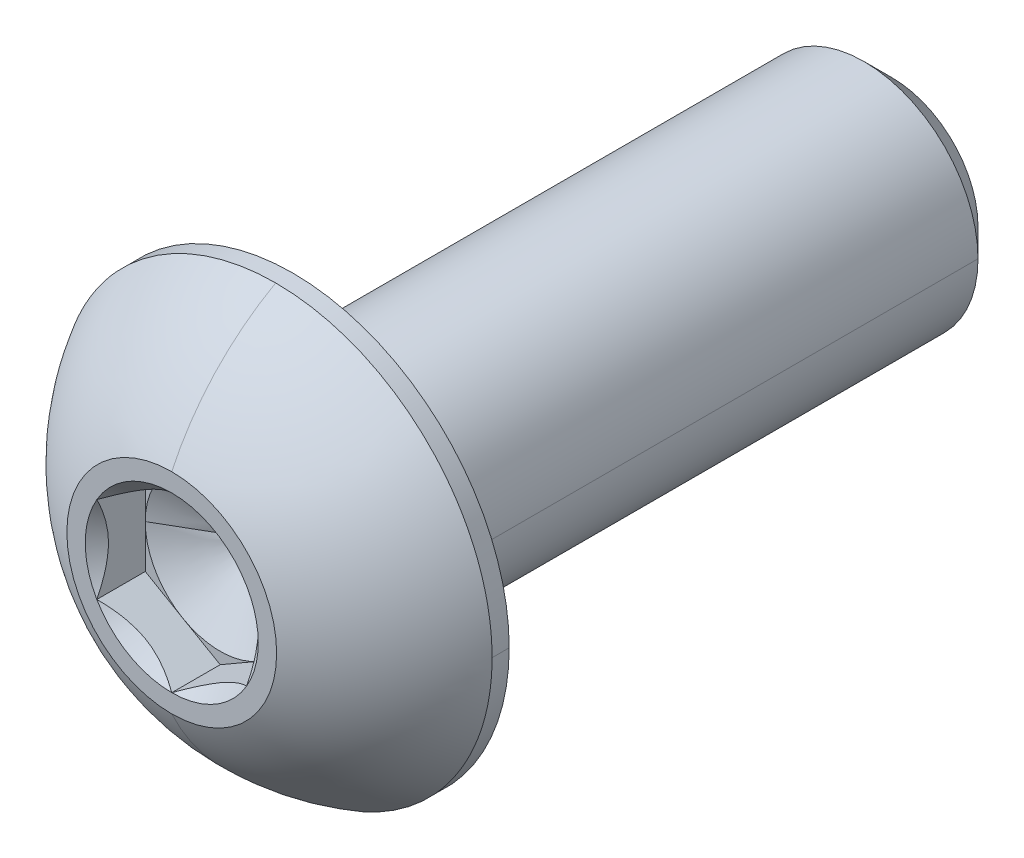
ISO-10303-21;
HEADER;
FILE_DESCRIPTION(('STEP AP214'),'2;1');
FILE_NAME('part.step','',(''),(''),'','','');
FILE_SCHEMA(('AUTOMOTIVE_DESIGN { 1 0 10303 214 1 1 1 1 }'));
ENDSEC;
DATA;
#1=APPLICATION_CONTEXT('core data for automotive mechanical design processes');
#2=APPLICATION_PROTOCOL_DEFINITION('international standard','automotive_design',2000,#1);
#3=PRODUCT_CONTEXT('',#1,'mechanical');
#4=PRODUCT('Part','Part','',(#3));
#5=PRODUCT_RELATED_PRODUCT_CATEGORY('part','',(#4));
#6=PRODUCT_DEFINITION_FORMATION('','',#4);
#7=PRODUCT_DEFINITION_CONTEXT('part definition',#1,'design');
#8=PRODUCT_DEFINITION('design','',#6,#7);
#9=PRODUCT_DEFINITION_SHAPE('','',#8);
#10=(LENGTH_UNIT() NAMED_UNIT(*) SI_UNIT(.MILLI.,.METRE.));
#11=(NAMED_UNIT(*) PLANE_ANGLE_UNIT() SI_UNIT($,.RADIAN.));
#12=(NAMED_UNIT(*) SI_UNIT($,.STERADIAN.) SOLID_ANGLE_UNIT());
#13=UNCERTAINTY_MEASURE_WITH_UNIT(LENGTH_MEASURE(1.E-05),#10,'distance_accuracy_value','');
#14=(GEOMETRIC_REPRESENTATION_CONTEXT(3) GLOBAL_UNCERTAINTY_ASSIGNED_CONTEXT((#13)) GLOBAL_UNIT_ASSIGNED_CONTEXT((#10,
#11,#12)) REPRESENTATION_CONTEXT('',''));
#15=CARTESIAN_POINT('',(0.,0.,0.));
#16=DIRECTION('',(0.,0.,1.));
#17=DIRECTION('',(1.,0.,0.));
#18=AXIS2_PLACEMENT_3D('',#15,#16,#17);
#19=CARTESIAN_POINT('',(0.,0.,7.6327));
#20=DIRECTION('',(0.,0.,1.));
#21=DIRECTION('',(1.,0.,0.));
#22=AXIS2_PLACEMENT_3D('',#19,#20,#21);
#23=CONICAL_SURFACE('',#22,1.83308710467706,0.78539816339745);
#24=CARTESIAN_POINT('',(0.,0.,7.6327));
#25=DIRECTION('',(0.,0.,1.));
#26=DIRECTION('',(1.,0.,0.));
#27=AXIS2_PLACEMENT_3D('',#24,#25,#26);
#28=CIRCLE('',#27,1.83308710467706);
#29=CARTESIAN_POINT('',(1.5875,0.916543552338531,7.6327));
#30=VERTEX_POINT('',#29);
#31=CARTESIAN_POINT('',(0.,1.83308710467706,7.6327));
#32=VERTEX_POINT('',#31);
#33=EDGE_CURVE('E202',#30,#32,#28,.T.);
#34=ORIENTED_EDGE('',*,*,#33,.T.);
#35=CARTESIAN_POINT('',(1.5875,0.916543552338532,7.6327));
#36=CARTESIAN_POINT('',(1.16394825928828,1.16108126385418,7.38816228848436));
#37=CARTESIAN_POINT('',(0.796673872668184,1.37312722983575,7.38711648546325));
#38=CARTESIAN_POINT('',(0.427185428297194,1.58645148265579,7.38606437797776));
#39=CARTESIAN_POINT('',(0.,1.83308710467706,7.6327));
#40=B_SPLINE_CURVE_WITH_KNOTS('',2,(#35,#36,#37,#38,#39),.UNSPECIFIED.,.F.,.F.,(3,2,3),(0.,0.5,
1.),.UNSPECIFIED.);
#41=EDGE_CURVE('E386',#30,#32,#40,.T.);
#42=ORIENTED_EDGE('',*,*,#41,.F.);
#43=EDGE_LOOP('',(#34,#42));
#44=FACE_BOUND('',#43,.T.);
#45=ADVANCED_FACE('F16',(#44),#23,.F.);
#46=CARTESIAN_POINT('',(0.,0.,7.6327));
#47=DIRECTION('',(0.,0.,1.));
#48=DIRECTION('',(1.,0.,0.));
#49=AXIS2_PLACEMENT_3D('',#46,#47,#48);
#50=CONICAL_SURFACE('',#49,1.83308710467706,0.78539816339745);
#51=DIRECTION('',(0.707106781186549,0.,0.707106781186546));
#52=VECTOR('',#51,1.);
#53=CARTESIAN_POINT('',(1.83308710467706,0.,7.6327));
#54=LINE('',#53,#52);
#55=CARTESIAN_POINT('',(1.5875,0.,7.38711289532294));
#56=VERTEX_POINT('',#55);
#57=CARTESIAN_POINT('',(1.83308710467706,0.,7.6327));
#58=VERTEX_POINT('',#57);
#59=EDGE_CURVE('E155',#56,#58,#54,.T.);
#60=ORIENTED_EDGE('',*,*,#59,.F.);
#61=CARTESIAN_POINT('',(1.5875,-0.916543552338531,7.6327));
#62=CARTESIAN_POINT('',(1.5875,-0.684378986322148,7.51661771699181));
#63=CARTESIAN_POINT('',(1.5875,-0.471870631820659,7.45575846355504));
#64=CARTESIAN_POINT('',(1.5875,-0.232174021608713,7.38711289532294));
#65=CARTESIAN_POINT('',(1.5875,0.,7.38711289532294));
#66=B_SPLINE_CURVE_WITH_KNOTS('',2,(#61,#62,#63,#64,#65),.UNSPECIFIED.,.F.,.F.,(3,2,3),(0.,0.5,
1.),.UNSPECIFIED.);
#67=CARTESIAN_POINT('',(1.5875,-0.916543552338531,7.6327));
#68=VERTEX_POINT('',#67);
#69=EDGE_CURVE('E148',#68,#56,#66,.T.);
#70=ORIENTED_EDGE('',*,*,#69,.F.);
#71=CARTESIAN_POINT('',(0.,0.,7.6327));
#72=DIRECTION('',(0.,0.,1.));
#73=DIRECTION('',(1.,0.,0.));
#74=AXIS2_PLACEMENT_3D('',#71,#72,#73);
#75=CIRCLE('',#74,1.83308710467706);
#76=EDGE_CURVE('E152',#68,#58,#75,.T.);
#77=ORIENTED_EDGE('',*,*,#76,.T.);
#78=EDGE_LOOP('',(#60,#70,#77));
#79=FACE_BOUND('',#78,.T.);
#80=ADVANCED_FACE('F150',(#79),#50,.F.);
#81=CARTESIAN_POINT('',(0.,0.,7.6327));
#82=DIRECTION('',(0.,0.,1.));
#83=DIRECTION('',(1.,0.,0.));
#84=AXIS2_PLACEMENT_3D('',#81,#82,#83);
#85=CONICAL_SURFACE('',#84,1.83308710467706,0.78539816339745);
#86=CARTESIAN_POINT('',(0.,0.,7.6327));
#87=DIRECTION('',(0.,0.,1.));
#88=DIRECTION('',(1.,0.,0.));
#89=AXIS2_PLACEMENT_3D('',#86,#87,#88);
#90=CIRCLE('',#89,1.83308710467706);
#91=CARTESIAN_POINT('',(0.,-1.83308710467706,7.6327));
#92=VERTEX_POINT('',#91);
#93=EDGE_CURVE('E188',#92,#68,#90,.T.);
#94=ORIENTED_EDGE('',*,*,#93,.T.);
#95=CARTESIAN_POINT('',(0.,-1.83308710467706,7.6327));
#96=CARTESIAN_POINT('',(0.423551740712969,-1.58854939316069,7.38816228848364));
#97=CARTESIAN_POINT('',(0.790826127331815,-1.37650342717985,7.38711648546325));
#98=CARTESIAN_POINT('',(1.16031457170405,-1.16317917435908,7.38606437797848));
#99=CARTESIAN_POINT('',(1.5875,-0.91654355233853,7.6327));
#100=B_SPLINE_CURVE_WITH_KNOTS('',2,(#95,#96,#97,#98,#99),.UNSPECIFIED.,.F.,.F.,(3,2,3),(0.,0.5,
1.),.UNSPECIFIED.);
#101=EDGE_CURVE('E172',#92,#68,#100,.T.);
#102=ORIENTED_EDGE('',*,*,#101,.F.);
#103=EDGE_LOOP('',(#94,#102));
#104=FACE_BOUND('',#103,.T.);
#105=ADVANCED_FACE('F189',(#104),#85,.F.);
#106=CARTESIAN_POINT('',(0.,0.,7.6327));
#107=DIRECTION('',(0.,0.,1.));
#108=DIRECTION('',(1.,0.,0.));
#109=AXIS2_PLACEMENT_3D('',#106,#107,#108);
#110=CONICAL_SURFACE('',#109,1.83308710467706,0.78539816339745);
#111=CARTESIAN_POINT('',(0.,0.,7.6327));
#112=DIRECTION('',(0.,0.,1.));
#113=DIRECTION('',(1.,0.,0.));
#114=AXIS2_PLACEMENT_3D('',#111,#112,#113);
#115=CIRCLE('',#114,1.83308710467706);
#116=CARTESIAN_POINT('',(-1.5875,-0.916543552338532,7.6327));
#117=VERTEX_POINT('',#116);
#118=EDGE_CURVE('E193',#117,#92,#115,.T.);
#119=ORIENTED_EDGE('',*,*,#118,.T.);
#120=CARTESIAN_POINT('',(-1.5875,-0.916543552338532,7.6327));
#121=CARTESIAN_POINT('',(-1.16394825928828,-1.16108126385418,7.38816228848436));
#122=CARTESIAN_POINT('',(-0.796673872668184,-1.37312722983575,7.38711648546325));
#123=CARTESIAN_POINT('',(-0.427185428297194,-1.58645148265579,7.38606437797777));
#124=CARTESIAN_POINT('',(0.,-1.83308710467706,7.6327));
#125=B_SPLINE_CURVE_WITH_KNOTS('',2,(#120,#121,#122,#123,#124),.UNSPECIFIED.,.F.,.F.,(3,2,3),
(0.,0.5,1.),.UNSPECIFIED.);
#126=EDGE_CURVE('E367',#117,#92,#125,.T.);
#127=ORIENTED_EDGE('',*,*,#126,.F.);
#128=EDGE_LOOP('',(#119,#127));
#129=FACE_BOUND('',#128,.T.);
#130=ADVANCED_FACE('F18',(#129),#110,.F.);
#131=CARTESIAN_POINT('',(0.,0.,7.6327));
#132=DIRECTION('',(0.,0.,1.));
#133=DIRECTION('',(1.,0.,0.));
#134=AXIS2_PLACEMENT_3D('',#131,#132,#133);
#135=CONICAL_SURFACE('',#134,1.83308710467706,0.78539816339745);
#136=CARTESIAN_POINT('',(0.,0.,7.6327));
#137=DIRECTION('',(0.,0.,1.));
#138=DIRECTION('',(1.,0.,0.));
#139=AXIS2_PLACEMENT_3D('',#136,#137,#138);
#140=CIRCLE('',#139,1.83308710467706);
#141=CARTESIAN_POINT('',(-1.5875,0.916543552338531,7.6327));
#142=VERTEX_POINT('',#141);
#143=EDGE_CURVE('E371',#142,#117,#140,.T.);
#144=ORIENTED_EDGE('',*,*,#143,.T.);
#145=CARTESIAN_POINT('',(-1.5875,0.916543552338531,7.6327));
#146=CARTESIAN_POINT('',(-1.5875,0.683298746668397,7.51607759716493));
#147=CARTESIAN_POINT('',(-1.5875,0.472019012921087,7.45580074655191));
#148=CARTESIAN_POINT('',(-1.5875,0.231534553260273,7.38719196144682));
#149=CARTESIAN_POINT('',(-1.5875,-1.26642650590545E-05,7.38711289537345));
#150=CARTESIAN_POINT('',(-1.5875,-0.230421051567736,7.38703421817469));
#151=CARTESIAN_POINT('',(-1.5875,-0.471876640894336,7.45576017567627));
#152=CARTESIAN_POINT('',(-1.5875,-0.68264892547495,7.51575268656821));
#153=CARTESIAN_POINT('',(-1.5875,-0.91654355233853,7.6327));
#154=B_SPLINE_CURVE_WITH_KNOTS('',2,(#145,#146,#147,#148,#149,#150,#151,#152,#153),
.UNSPECIFIED.,.F.,.F.,(3,2,2,2,3),(0.,0.25,0.5,0.75,1.),.UNSPECIFIED.);
#155=EDGE_CURVE('E404',#142,#117,#154,.T.);
#156=ORIENTED_EDGE('',*,*,#155,.F.);
#157=EDGE_LOOP('',(#144,#156));
#158=FACE_BOUND('',#157,.T.);
#159=ADVANCED_FACE('F256',(#158),#135,.F.);
#160=CARTESIAN_POINT('',(0.,0.,7.6327));
#161=DIRECTION('',(0.,0.,1.));
#162=DIRECTION('',(1.,0.,0.));
#163=AXIS2_PLACEMENT_3D('',#160,#161,#162);
#164=CONICAL_SURFACE('',#163,1.83308710467706,0.78539816339745);
#165=CARTESIAN_POINT('',(0.,0.,7.6327));
#166=DIRECTION('',(0.,0.,1.));
#167=DIRECTION('',(1.,0.,0.));
#168=AXIS2_PLACEMENT_3D('',#165,#166,#167);
#169=CIRCLE('',#168,1.83308710467706);
#170=EDGE_CURVE('E210',#32,#142,#169,.T.);
#171=ORIENTED_EDGE('',*,*,#170,.T.);
#172=CARTESIAN_POINT('',(0.,1.83308710467706,7.6327));
#173=CARTESIAN_POINT('',(-0.423551740711718,1.58854939316142,7.38816228848435));
#174=CARTESIAN_POINT('',(-0.790826127331815,1.37650342717985,7.38711648546325));
#175=CARTESIAN_POINT('',(-1.16031457170281,1.1631791743598,7.38606437797777));
#176=CARTESIAN_POINT('',(-1.5875,0.91654355233853,7.6327));
#177=B_SPLINE_CURVE_WITH_KNOTS('',2,(#172,#173,#174,#175,#176),.UNSPECIFIED.,.F.,.F.,(3,2,3),
(0.,0.5,1.),.UNSPECIFIED.);
#178=EDGE_CURVE('E424',#32,#142,#177,.T.);
#179=ORIENTED_EDGE('',*,*,#178,.F.);
#180=EDGE_LOOP('',(#171,#179));
#181=FACE_BOUND('',#180,.T.);
#182=ADVANCED_FACE('F541',(#181),#164,.F.);
#183=CARTESIAN_POINT('',(0.,0.,6.60654));
#184=DIRECTION('',(0.,0.,1.));
#185=DIRECTION('',(1.,0.,0.));
#186=AXIS2_PLACEMENT_3D('',#183,#184,#185);
#187=CONICAL_SURFACE('',#186,1.5875,1.0471975511966);
#188=DIRECTION('',(-0.86602540378444,0.,0.5));
#189=VECTOR('',#188,1.);
#190=CARTESIAN_POINT('',(-1.5875,0.,6.60654));
#191=LINE('',#190,#189);
#192=CARTESIAN_POINT('',(0.,0.,5.68999644766147));
#193=VERTEX_POINT('',#192);
#194=CARTESIAN_POINT('',(-1.5875,0.,6.60654));
#195=VERTEX_POINT('',#194);
#196=EDGE_CURVE('E308',#193,#195,#191,.T.);
#197=ORIENTED_EDGE('',*,*,#196,.F.);
#198=DIRECTION('',(0.86602540378444,0.,0.5));
#199=VECTOR('',#198,1.);
#200=CARTESIAN_POINT('',(1.5875,0.,6.60654));
#201=LINE('',#200,#199);
#202=CARTESIAN_POINT('',(1.5875,0.,6.60654));
#203=VERTEX_POINT('',#202);
#204=EDGE_CURVE('E226',#193,#203,#201,.T.);
#205=ORIENTED_EDGE('',*,*,#204,.T.);
#206=CARTESIAN_POINT('',(0.,0.,6.60654));
#207=DIRECTION('',(0.,0.,1.));
#208=DIRECTION('',(1.,0.,0.));
#209=AXIS2_PLACEMENT_3D('',#206,#207,#208);
#210=CIRCLE('',#209,1.5875);
#211=CARTESIAN_POINT('',(0.79375,1.3748153285078,6.60654));
#212=VERTEX_POINT('',#211);
#213=EDGE_CURVE('E11',#203,#212,#210,.T.);
#214=ORIENTED_EDGE('',*,*,#213,.T.);
#215=CARTESIAN_POINT('',(0.,0.,6.60654));
#216=DIRECTION('',(0.,0.,1.));
#217=DIRECTION('',(1.,0.,0.));
#218=AXIS2_PLACEMENT_3D('',#215,#216,#217);
#219=CIRCLE('',#218,1.5875);
#220=CARTESIAN_POINT('',(-0.79375,1.3748153285078,6.60654));
#221=VERTEX_POINT('',#220);
#222=EDGE_CURVE('E30',#212,#221,#219,.T.);
#223=ORIENTED_EDGE('',*,*,#222,.T.);
#224=CARTESIAN_POINT('',(0.,0.,6.60654));
#225=DIRECTION('',(0.,0.,1.));
#226=DIRECTION('',(1.,0.,0.));
#227=AXIS2_PLACEMENT_3D('',#224,#225,#226);
#228=CIRCLE('',#227,1.5875);
#229=EDGE_CURVE('E314',#221,#195,#228,.T.);
#230=ORIENTED_EDGE('',*,*,#229,.T.);
#231=EDGE_LOOP('',(#197,#205,#214,#223,#230));
#232=FACE_BOUND('',#231,.T.);
#233=ADVANCED_FACE('F478',(#232),#187,.F.);
#234=CARTESIAN_POINT('',(0.,0.,6.60654));
#235=DIRECTION('',(0.,0.,1.));
#236=DIRECTION('',(1.,0.,0.));
#237=AXIS2_PLACEMENT_3D('',#234,#235,#236);
#238=PLANE('',#237);
#239=ORIENTED_EDGE('',*,*,#213,.F.);
#240=DIRECTION('',(0.,1.,0.));
#241=VECTOR('',#240,1.);
#242=CARTESIAN_POINT('',(1.5875,-0.916543552338531,6.60654));
#243=LINE('',#242,#241);
#244=CARTESIAN_POINT('',(1.5875,0.916543552338532,6.60654));
#245=VERTEX_POINT('',#244);
#246=EDGE_CURVE('E160',#203,#245,#243,.T.);
#247=ORIENTED_EDGE('',*,*,#246,.T.);
#248=DIRECTION('',(-0.866025403784439,0.5,0.));
#249=VECTOR('',#248,1.);
#250=CARTESIAN_POINT('',(1.5875,0.916543552338532,6.60654));
#251=LINE('',#250,#249);
#252=EDGE_CURVE('E357',#245,#212,#251,.T.);
#253=ORIENTED_EDGE('',*,*,#252,.T.);
#254=EDGE_LOOP('',(#239,#247,#253));
#255=FACE_BOUND('',#254,.T.);
#256=ADVANCED_FACE('F474',(#255),#238,.T.);
#257=CARTESIAN_POINT('',(0.,0.,6.60654));
#258=DIRECTION('',(0.,0.,1.));
#259=DIRECTION('',(1.,0.,0.));
#260=AXIS2_PLACEMENT_3D('',#257,#258,#259);
#261=PLANE('',#260);
#262=ORIENTED_EDGE('',*,*,#222,.F.);
#263=DIRECTION('',(-0.866025403784439,0.5,0.));
#264=VECTOR('',#263,1.);
#265=CARTESIAN_POINT('',(1.5875,0.916543552338532,6.60654));
#266=LINE('',#265,#264);
#267=CARTESIAN_POINT('',(0.,1.83308710467706,6.60654));
#268=VERTEX_POINT('',#267);
#269=EDGE_CURVE('E353',#212,#268,#266,.T.);
#270=ORIENTED_EDGE('',*,*,#269,.T.);
#271=DIRECTION('',(-0.866025403784438,-0.5,0.));
#272=VECTOR('',#271,1.);
#273=CARTESIAN_POINT('',(0.,1.83308710467706,6.60654));
#274=LINE('',#273,#272);
#275=EDGE_CURVE('E301',#268,#221,#274,.T.);
#276=ORIENTED_EDGE('',*,*,#275,.T.);
#277=EDGE_LOOP('',(#262,#270,#276));
#278=FACE_BOUND('',#277,.T.);
#279=ADVANCED_FACE('F477',(#278),#261,.T.);
#280=CARTESIAN_POINT('',(0.,0.,6.60654));
#281=DIRECTION('',(0.,0.,1.));
#282=DIRECTION('',(1.,0.,0.));
#283=AXIS2_PLACEMENT_3D('',#280,#281,#282);
#284=PLANE('',#283);
#285=ORIENTED_EDGE('',*,*,#229,.F.);
#286=DIRECTION('',(-0.866025403784438,-0.5,0.));
#287=VECTOR('',#286,1.);
#288=CARTESIAN_POINT('',(0.,1.83308710467706,6.60654));
#289=LINE('',#288,#287);
#290=CARTESIAN_POINT('',(-1.5875,0.91654355233853,6.60654));
#291=VERTEX_POINT('',#290);
#292=EDGE_CURVE('E297',#221,#291,#289,.T.);
#293=ORIENTED_EDGE('',*,*,#292,.T.);
#294=DIRECTION('',(0.,-1.,0.));
#295=VECTOR('',#294,1.);
#296=CARTESIAN_POINT('',(-1.5875,0.91654355233853,6.60654));
#297=LINE('',#296,#295);
#298=EDGE_CURVE('E363',#291,#195,#297,.T.);
#299=ORIENTED_EDGE('',*,*,#298,.T.);
#300=EDGE_LOOP('',(#285,#293,#299));
#301=FACE_BOUND('',#300,.T.);
#302=ADVANCED_FACE('F697',(#301),#284,.T.);
#303=CARTESIAN_POINT('',(0.,0.,6.60654));
#304=DIRECTION('',(0.,0.,1.));
#305=DIRECTION('',(1.,0.,0.));
#306=AXIS2_PLACEMENT_3D('',#303,#304,#305);
#307=PLANE('',#306);
#308=CARTESIAN_POINT('',(0.,0.,6.60654));
#309=DIRECTION('',(0.,0.,1.));
#310=DIRECTION('',(1.,0.,0.));
#311=AXIS2_PLACEMENT_3D('',#308,#309,#310);
#312=CIRCLE('',#311,1.5875);
#313=CARTESIAN_POINT('',(-0.79375,-1.3748153285078,6.60654));
#314=VERTEX_POINT('',#313);
#315=EDGE_CURVE('E303',#195,#314,#312,.T.);
#316=ORIENTED_EDGE('',*,*,#315,.F.);
#317=DIRECTION('',(0.,-1.,0.));
#318=VECTOR('',#317,1.);
#319=CARTESIAN_POINT('',(-1.5875,0.91654355233853,6.60654));
#320=LINE('',#319,#318);
#321=CARTESIAN_POINT('',(-1.5875,-0.916543552338532,6.60654));
#322=VERTEX_POINT('',#321);
#323=EDGE_CURVE('E368',#195,#322,#320,.T.);
#324=ORIENTED_EDGE('',*,*,#323,.T.);
#325=DIRECTION('',(0.866025403784439,-0.5,0.));
#326=VECTOR('',#325,1.);
#327=CARTESIAN_POINT('',(-1.5875,-0.916543552338532,6.60654));
#328=LINE('',#327,#326);
#329=EDGE_CURVE('E184',#322,#314,#328,.T.);
#330=ORIENTED_EDGE('',*,*,#329,.T.);
#331=EDGE_LOOP('',(#316,#324,#330));
#332=FACE_BOUND('',#331,.T.);
#333=ADVANCED_FACE('F485',(#332),#307,.T.);
#334=CARTESIAN_POINT('',(0.,0.,6.60654));
#335=DIRECTION('',(0.,0.,1.));
#336=DIRECTION('',(1.,0.,0.));
#337=AXIS2_PLACEMENT_3D('',#334,#335,#336);
#338=PLANE('',#337);
#339=CARTESIAN_POINT('',(0.,0.,6.60654));
#340=DIRECTION('',(0.,0.,1.));
#341=DIRECTION('',(1.,0.,0.));
#342=AXIS2_PLACEMENT_3D('',#339,#340,#341);
#343=CIRCLE('',#342,1.5875);
#344=CARTESIAN_POINT('',(0.79375,-1.3748153285078,6.60654));
#345=VERTEX_POINT('',#344);
#346=EDGE_CURVE('E307',#314,#345,#343,.T.);
#347=ORIENTED_EDGE('',*,*,#346,.F.);
#348=DIRECTION('',(0.866025403784439,-0.5,0.));
#349=VECTOR('',#348,1.);
#350=CARTESIAN_POINT('',(-1.5875,-0.916543552338532,6.60654));
#351=LINE('',#350,#349);
#352=CARTESIAN_POINT('',(0.,-1.83308710467706,6.60654));
#353=VERTEX_POINT('',#352);
#354=EDGE_CURVE('E362',#314,#353,#351,.T.);
#355=ORIENTED_EDGE('',*,*,#354,.T.);
#356=DIRECTION('',(0.866025403784438,0.5,0.));
#357=VECTOR('',#356,1.);
#358=CARTESIAN_POINT('',(0.,-1.83308710467706,6.60654));
#359=LINE('',#358,#357);
#360=EDGE_CURVE('E161',#353,#345,#359,.T.);
#361=ORIENTED_EDGE('',*,*,#360,.T.);
#362=EDGE_LOOP('',(#347,#355,#361));
#363=FACE_BOUND('',#362,.T.);
#364=ADVANCED_FACE('F683',(#363),#338,.T.);
#365=CARTESIAN_POINT('',(0.,0.,6.60654));
#366=DIRECTION('',(0.,0.,1.));
#367=DIRECTION('',(1.,0.,0.));
#368=AXIS2_PLACEMENT_3D('',#365,#366,#367);
#369=PLANE('',#368);
#370=CARTESIAN_POINT('',(0.,0.,6.60654));
#371=DIRECTION('',(0.,0.,1.));
#372=DIRECTION('',(1.,0.,0.));
#373=AXIS2_PLACEMENT_3D('',#370,#371,#372);
#374=CIRCLE('',#373,1.5875);
#375=EDGE_CURVE('E287',#345,#203,#374,.T.);
#376=ORIENTED_EDGE('',*,*,#375,.F.);
#377=DIRECTION('',(0.866025403784438,0.5,0.));
#378=VECTOR('',#377,1.);
#379=CARTESIAN_POINT('',(0.,-1.83308710467706,6.60654));
#380=LINE('',#379,#378);
#381=CARTESIAN_POINT('',(1.5875,-0.916543552338531,6.60654));
#382=VERTEX_POINT('',#381);
#383=EDGE_CURVE('E171',#345,#382,#380,.T.);
#384=ORIENTED_EDGE('',*,*,#383,.T.);
#385=DIRECTION('',(0.,1.,0.));
#386=VECTOR('',#385,1.);
#387=CARTESIAN_POINT('',(1.5875,-0.916543552338531,6.60654));
#388=LINE('',#387,#386);
#389=EDGE_CURVE('E45',#382,#203,#388,.T.);
#390=ORIENTED_EDGE('',*,*,#389,.T.);
#391=EDGE_LOOP('',(#376,#384,#390));
#392=FACE_BOUND('',#391,.T.);
#393=ADVANCED_FACE('F255',(#392),#369,.T.);
#394=CARTESIAN_POINT('',(1.5875,-0.916543552338531,7.6327));
#395=DIRECTION('',(-1.,0.,0.));
#396=DIRECTION('',(0.,1.,0.));
#397=AXIS2_PLACEMENT_3D('',#394,#395,#396);
#398=PLANE('',#397);
#399=ORIENTED_EDGE('',*,*,#69,.T.);
#400=CARTESIAN_POINT('',(1.5875,0.,7.38711289532294));
#401=CARTESIAN_POINT('',(1.5875,0.229762965263691,7.38711289532294));
#402=CARTESIAN_POINT('',(1.5875,0.472025034449919,7.45580246271759));
#403=CARTESIAN_POINT('',(1.5875,0.681581043057984,7.51521874535973));
#404=CARTESIAN_POINT('',(1.5875,0.916543552338529,7.6327));
#405=B_SPLINE_CURVE_WITH_KNOTS('',2,(#400,#401,#402,#403,#404),.UNSPECIFIED.,.F.,.F.,(3,2,3),
(0.,0.5,1.),.UNSPECIFIED.);
#406=EDGE_CURVE('E218',#56,#30,#405,.T.);
#407=ORIENTED_EDGE('',*,*,#406,.T.);
#408=DIRECTION('',(0.,0.,-1.));
#409=VECTOR('',#408,1.);
#410=CARTESIAN_POINT('',(1.5875,0.916543552338532,7.6327));
#411=LINE('',#410,#409);
#412=EDGE_CURVE('E236',#30,#245,#411,.T.);
#413=ORIENTED_EDGE('',*,*,#412,.T.);
#414=ORIENTED_EDGE('',*,*,#246,.F.);
#415=ORIENTED_EDGE('',*,*,#389,.F.);
#416=DIRECTION('',(0.,0.,-1.));
#417=VECTOR('',#416,1.);
#418=CARTESIAN_POINT('',(1.5875,-0.916543552338531,7.6327));
#419=LINE('',#418,#417);
#420=EDGE_CURVE('E165',#68,#382,#419,.T.);
#421=ORIENTED_EDGE('',*,*,#420,.F.);
#422=EDGE_LOOP('',(#399,#407,#413,#414,#415,#421));
#423=FACE_BOUND('',#422,.T.);
#424=ADVANCED_FACE('F167',(#423),#398,.T.);
#425=CARTESIAN_POINT('',(0.,-1.83308710467706,7.6327));
#426=DIRECTION('',(-0.5,0.866025403784438,0.));
#427=DIRECTION('',(0.,0.,1.));
#428=AXIS2_PLACEMENT_3D('',#425,#426,#427);
#429=PLANE('',#428);
#430=ORIENTED_EDGE('',*,*,#101,.T.);
#431=ORIENTED_EDGE('',*,*,#420,.T.);
#432=ORIENTED_EDGE('',*,*,#383,.F.);
#433=ORIENTED_EDGE('',*,*,#360,.F.);
#434=DIRECTION('',(0.,0.,-1.));
#435=VECTOR('',#434,1.);
#436=CARTESIAN_POINT('',(0.,-1.83308710467706,7.6327));
#437=LINE('',#436,#435);
#438=EDGE_CURVE('E179',#92,#353,#437,.T.);
#439=ORIENTED_EDGE('',*,*,#438,.F.);
#440=EDGE_LOOP('',(#430,#431,#432,#433,#439));
#441=FACE_BOUND('',#440,.T.);
#442=ADVANCED_FACE('F177',(#441),#429,.T.);
#443=CARTESIAN_POINT('',(-1.5875,-0.916543552338532,7.6327));
#444=DIRECTION('',(0.5,0.866025403784439,0.));
#445=DIRECTION('',(0.,0.,-1.));
#446=AXIS2_PLACEMENT_3D('',#443,#444,#445);
#447=PLANE('',#446);
#448=ORIENTED_EDGE('',*,*,#126,.T.);
#449=ORIENTED_EDGE('',*,*,#438,.T.);
#450=ORIENTED_EDGE('',*,*,#354,.F.);
#451=ORIENTED_EDGE('',*,*,#329,.F.);
#452=DIRECTION('',(0.,0.,-1.));
#453=VECTOR('',#452,1.);
#454=CARTESIAN_POINT('',(-1.5875,-0.916543552338532,7.6327));
#455=LINE('',#454,#453);
#456=EDGE_CURVE('E378',#117,#322,#455,.T.);
#457=ORIENTED_EDGE('',*,*,#456,.F.);
#458=EDGE_LOOP('',(#448,#449,#450,#451,#457));
#459=FACE_BOUND('',#458,.T.);
#460=ADVANCED_FACE('F451',(#459),#447,.T.);
#461=CARTESIAN_POINT('',(-1.5875,0.91654355233853,7.6327));
#462=DIRECTION('',(1.,0.,0.));
#463=DIRECTION('',(0.,1.,0.));
#464=AXIS2_PLACEMENT_3D('',#461,#462,#463);
#465=PLANE('',#464);
#466=ORIENTED_EDGE('',*,*,#155,.T.);
#467=ORIENTED_EDGE('',*,*,#456,.T.);
#468=ORIENTED_EDGE('',*,*,#323,.F.);
#469=ORIENTED_EDGE('',*,*,#298,.F.);
#470=DIRECTION('',(0.,0.,-1.));
#471=VECTOR('',#470,1.);
#472=CARTESIAN_POINT('',(-1.5875,0.91654355233853,7.6327));
#473=LINE('',#472,#471);
#474=EDGE_CURVE('E302',#142,#291,#473,.T.);
#475=ORIENTED_EDGE('',*,*,#474,.F.);
#476=EDGE_LOOP('',(#466,#467,#468,#469,#475));
#477=FACE_BOUND('',#476,.T.);
#478=ADVANCED_FACE('F479',(#477),#465,.T.);
#479=CARTESIAN_POINT('',(0.,1.83308710467706,7.6327));
#480=DIRECTION('',(0.5,-0.866025403784438,0.));
#481=DIRECTION('',(0.,0.,-1.));
#482=AXIS2_PLACEMENT_3D('',#479,#480,#481);
#483=PLANE('',#482);
#484=ORIENTED_EDGE('',*,*,#178,.T.);
#485=ORIENTED_EDGE('',*,*,#474,.T.);
#486=ORIENTED_EDGE('',*,*,#292,.F.);
#487=ORIENTED_EDGE('',*,*,#275,.F.);
#488=DIRECTION('',(0.,0.,-1.));
#489=VECTOR('',#488,1.);
#490=CARTESIAN_POINT('',(0.,1.83308710467706,7.6327));
#491=LINE('',#490,#489);
#492=EDGE_CURVE('E358',#32,#268,#491,.T.);
#493=ORIENTED_EDGE('',*,*,#492,.F.);
#494=EDGE_LOOP('',(#484,#485,#486,#487,#493));
#495=FACE_BOUND('',#494,.T.);
#496=ADVANCED_FACE('F483',(#495),#483,.T.);
#497=CARTESIAN_POINT('',(1.5875,0.916543552338532,7.6327));
#498=DIRECTION('',(-0.5,-0.866025403784439,0.));
#499=DIRECTION('',(-0.866025403784439,0.5,0.));
#500=AXIS2_PLACEMENT_3D('',#497,#498,#499);
#501=PLANE('',#500);
#502=ORIENTED_EDGE('',*,*,#41,.T.);
#503=ORIENTED_EDGE('',*,*,#492,.T.);
#504=ORIENTED_EDGE('',*,*,#269,.F.);
#505=ORIENTED_EDGE('',*,*,#252,.F.);
#506=ORIENTED_EDGE('',*,*,#412,.F.);
#507=EDGE_LOOP('',(#502,#503,#504,#505,#506));
#508=FACE_BOUND('',#507,.T.);
#509=ADVANCED_FACE('F537',(#508),#501,.T.);
#510=CARTESIAN_POINT('',(0.,1.8176748,-7.6327));
#511=DIRECTION('',(0.,0.,1.));
#512=DIRECTION('',(1.,0.,0.));
#513=AXIS2_PLACEMENT_3D('',#510,#511,#512);
#514=PLANE('',#513);
#515=CARTESIAN_POINT('',(0.,0.,-7.6327));
#516=DIRECTION('',(0.,0.,1.));
#517=DIRECTION('',(1.,0.,0.));
#518=AXIS2_PLACEMENT_3D('',#515,#516,#517);
#519=CIRCLE('',#518,1.8176748);
#520=CARTESIAN_POINT('',(1.8176748,0.,-7.6327));
#521=VERTEX_POINT('',#520);
#522=CARTESIAN_POINT('',(-1.8176748,0.,-7.6327));
#523=VERTEX_POINT('',#522);
#524=EDGE_CURVE('E336',#521,#523,#519,.T.);
#525=ORIENTED_EDGE('',*,*,#524,.F.);
#526=CARTESIAN_POINT('',(0.,0.,-7.6327));
#527=DIRECTION('',(0.,0.,1.));
#528=DIRECTION('',(1.,0.,0.));
#529=AXIS2_PLACEMENT_3D('',#526,#527,#528);
#530=CIRCLE('',#529,1.8176748);
#531=EDGE_CURVE('E289',#523,#521,#530,.T.);
#532=ORIENTED_EDGE('',*,*,#531,.F.);
#533=EDGE_LOOP('',(#525,#532));
#534=FACE_BOUND('',#533,.T.);
#535=ADVANCED_FACE('F572',(#534),#514,.F.);
#536=CARTESIAN_POINT('',(0.,0.,2.88110962579431));
#537=DIRECTION('',(-1.,0.,0.));
#538=DIRECTION('',(0.,1.,0.));
#539=AXIS2_PLACEMENT_3D('',#536,#537,#538);
#540=SPHERICAL_SURFACE('',#539,5.24567606074224);
#541=CARTESIAN_POINT('',(0.,0.,2.88110962579431));
#542=DIRECTION('',(-1.,0.,0.));
#543=DIRECTION('',(0.,-1.,0.));
#544=AXIS2_PLACEMENT_3D('',#541,#542,#543);
#545=CIRCLE('',#544,5.24567606074224);
#546=CARTESIAN_POINT('',(0.,-4.5847,5.43015714285714));
#547=VERTEX_POINT('',#546);
#548=CARTESIAN_POINT('',(0.,-2.2225,7.6327));
#549=VERTEX_POINT('',#548);
#550=EDGE_CURVE('E278',#547,#549,#545,.T.);
#551=ORIENTED_EDGE('',*,*,#550,.F.);
#552=CARTESIAN_POINT('',(0.,0.,5.43015714285714));
#553=DIRECTION('',(0.,0.,1.));
#554=DIRECTION('',(1.,0.,0.));
#555=AXIS2_PLACEMENT_3D('',#552,#553,#554);
#556=CIRCLE('',#555,4.5847);
#557=CARTESIAN_POINT('',(4.5847,0.,5.43015714285714));
#558=VERTEX_POINT('',#557);
#559=EDGE_CURVE('E347',#547,#558,#556,.T.);
#560=ORIENTED_EDGE('',*,*,#559,.T.);
#561=CARTESIAN_POINT('',(0.,0.,5.43015714285714));
#562=DIRECTION('',(0.,0.,1.));
#563=DIRECTION('',(1.,0.,0.));
#564=AXIS2_PLACEMENT_3D('',#561,#562,#563);
#565=CIRCLE('',#564,4.5847);
#566=CARTESIAN_POINT('',(0.,4.5847,5.43015714285714));
#567=VERTEX_POINT('',#566);
#568=EDGE_CURVE('E291',#558,#567,#565,.T.);
#569=ORIENTED_EDGE('',*,*,#568,.T.);
#570=CARTESIAN_POINT('',(0.,0.,2.88110962579431));
#571=DIRECTION('',(1.,0.,0.));
#572=DIRECTION('',(0.,0.,-1.));
#573=AXIS2_PLACEMENT_3D('',#570,#571,#572);
#574=CIRCLE('',#573,5.24567606074224);
#575=CARTESIAN_POINT('',(0.,2.2225,7.6327));
#576=VERTEX_POINT('',#575);
#577=EDGE_CURVE('E309',#567,#576,#574,.T.);
#578=ORIENTED_EDGE('',*,*,#577,.T.);
#579=CARTESIAN_POINT('',(0.,0.,7.6327));
#580=DIRECTION('',(0.,0.,1.));
#581=DIRECTION('',(1.,0.,0.));
#582=AXIS2_PLACEMENT_3D('',#579,#580,#581);
#583=CIRCLE('',#582,2.2225);
#584=EDGE_CURVE('E324',#549,#576,#583,.T.);
#585=ORIENTED_EDGE('',*,*,#584,.F.);
#586=EDGE_LOOP('',(#551,#560,#569,#578,#585));
#587=FACE_BOUND('',#586,.T.);
#588=ADVANCED_FACE('F660',(#587),#540,.T.);
#589=CARTESIAN_POINT('',(0.,0.,7.6327));
#590=DIRECTION('',(0.,0.,1.));
#591=DIRECTION('',(1.,0.,0.));
#592=AXIS2_PLACEMENT_3D('',#589,#590,#591);
#593=CYLINDRICAL_SURFACE('',#592,4.5847);
#594=DIRECTION('',(0.,0.,1.));
#595=VECTOR('',#594,1.);
#596=CARTESIAN_POINT('',(-4.5847,0.,7.6327));
#597=LINE('',#596,#595);
#598=CARTESIAN_POINT('',(-4.5847,0.,5.0673));
#599=VERTEX_POINT('',#598);
#600=CARTESIAN_POINT('',(-4.5847,0.,5.43015714285714));
#601=VERTEX_POINT('',#600);
#602=EDGE_CURVE('E296',#599,#601,#597,.T.);
#603=ORIENTED_EDGE('',*,*,#602,.F.);
#604=CARTESIAN_POINT('',(0.,0.,5.0673));
#605=DIRECTION('',(0.,0.,1.));
#606=DIRECTION('',(1.,0.,0.));
#607=AXIS2_PLACEMENT_3D('',#604,#605,#606);
#608=CIRCLE('',#607,4.5847);
#609=CARTESIAN_POINT('',(4.5847,0.,5.0673));
#610=VERTEX_POINT('',#609);
#611=EDGE_CURVE('E277',#599,#610,#608,.T.);
#612=ORIENTED_EDGE('',*,*,#611,.T.);
#613=DIRECTION('',(0.,0.,1.));
#614=VECTOR('',#613,1.);
#615=CARTESIAN_POINT('',(4.5847,0.,7.6327));
#616=LINE('',#615,#614);
#617=EDGE_CURVE('E295',#610,#558,#616,.T.);
#618=ORIENTED_EDGE('',*,*,#617,.T.);
#619=ORIENTED_EDGE('',*,*,#559,.F.);
#620=CARTESIAN_POINT('',(0.,0.,5.43015714285714));
#621=DIRECTION('',(0.,0.,1.));
#622=DIRECTION('',(1.,0.,0.));
#623=AXIS2_PLACEMENT_3D('',#620,#621,#622);
#624=CIRCLE('',#623,4.5847);
#625=EDGE_CURVE('E283',#601,#547,#624,.T.);
#626=ORIENTED_EDGE('',*,*,#625,.F.);
#627=EDGE_LOOP('',(#603,#612,#618,#619,#626));
#628=FACE_BOUND('',#627,.T.);
#629=ADVANCED_FACE('F656',(#628),#593,.T.);
#630=CARTESIAN_POINT('',(0.,4.5847,5.0673));
#631=DIRECTION('',(0.,0.,1.));
#632=DIRECTION('',(1.,0.,0.));
#633=AXIS2_PLACEMENT_3D('',#630,#631,#632);
#634=PLANE('',#633);
#635=CARTESIAN_POINT('',(0.,0.,5.0673));
#636=DIRECTION('',(0.,0.,1.));
#637=DIRECTION('',(1.,0.,0.));
#638=AXIS2_PLACEMENT_3D('',#635,#636,#637);
#639=CIRCLE('',#638,2.413);
#640=CARTESIAN_POINT('',(2.413,0.,5.0673));
#641=VERTEX_POINT('',#640);
#642=CARTESIAN_POINT('',(-2.413,0.,5.0673));
#643=VERTEX_POINT('',#642);
#644=EDGE_CURVE('E319',#641,#643,#639,.T.);
#645=ORIENTED_EDGE('',*,*,#644,.T.);
#646=CARTESIAN_POINT('',(0.,0.,5.0673));
#647=DIRECTION('',(0.,0.,1.));
#648=DIRECTION('',(1.,0.,0.));
#649=AXIS2_PLACEMENT_3D('',#646,#647,#648);
#650=CIRCLE('',#649,2.413);
#651=EDGE_CURVE('E273',#643,#641,#650,.T.);
#652=ORIENTED_EDGE('',*,*,#651,.T.);
#653=EDGE_LOOP('',(#645,#652));
#654=FACE_BOUND('',#653,.T.);
#655=CARTESIAN_POINT('',(0.,0.,5.0673));
#656=DIRECTION('',(0.,0.,1.));
#657=DIRECTION('',(1.,0.,0.));
#658=AXIS2_PLACEMENT_3D('',#655,#656,#657);
#659=CIRCLE('',#658,4.5847);
#660=EDGE_CURVE('E340',#610,#599,#659,.T.);
#661=ORIENTED_EDGE('',*,*,#660,.F.);
#662=ORIENTED_EDGE('',*,*,#611,.F.);
#663=EDGE_LOOP('',(#661,#662));
#664=FACE_BOUND('',#663,.T.);
#665=ADVANCED_FACE('F679',(#654,#664),#634,.F.);
#666=CARTESIAN_POINT('',(0.,0.,7.6327));
#667=DIRECTION('',(0.,0.,1.));
#668=DIRECTION('',(1.,0.,0.));
#669=AXIS2_PLACEMENT_3D('',#666,#667,#668);
#670=CYLINDRICAL_SURFACE('',#669,2.413);
#671=DIRECTION('',(0.,0.,1.));
#672=VECTOR('',#671,1.);
#673=CARTESIAN_POINT('',(-2.413,0.,7.6327));
#674=LINE('',#673,#672);
#675=CARTESIAN_POINT('',(-2.413,0.,-7.0373748));
#676=VERTEX_POINT('',#675);
#677=EDGE_CURVE('E315',#676,#643,#674,.T.);
#678=ORIENTED_EDGE('',*,*,#677,.F.);
#679=CARTESIAN_POINT('',(0.,0.,-7.0373748));
#680=DIRECTION('',(0.,0.,1.));
#681=DIRECTION('',(1.,0.,0.));
#682=AXIS2_PLACEMENT_3D('',#679,#680,#681);
#683=CIRCLE('',#682,2.413);
#684=CARTESIAN_POINT('',(2.413,0.,-7.0373748));
#685=VERTEX_POINT('',#684);
#686=EDGE_CURVE('E117',#676,#685,#683,.T.);
#687=ORIENTED_EDGE('',*,*,#686,.T.);
#688=DIRECTION('',(0.,0.,1.));
#689=VECTOR('',#688,1.);
#690=CARTESIAN_POINT('',(2.413,0.,7.6327));
#691=LINE('',#690,#689);
#692=EDGE_CURVE('E334',#685,#641,#691,.T.);
#693=ORIENTED_EDGE('',*,*,#692,.T.);
#694=ORIENTED_EDGE('',*,*,#651,.F.);
#695=EDGE_LOOP('',(#678,#687,#693,#694));
#696=FACE_BOUND('',#695,.T.);
#697=ADVANCED_FACE('F676',(#696),#670,.T.);
#698=CARTESIAN_POINT('',(0.,0.,-7.6327));
#699=DIRECTION('',(0.,0.,1.));
#700=DIRECTION('',(1.,0.,0.));
#701=AXIS2_PLACEMENT_3D('',#698,#699,#700);
#702=CONICAL_SURFACE('',#701,1.8176748,0.785398163397448);
#703=DIRECTION('',(-0.707106781186547,0.,0.707106781186548));
#704=VECTOR('',#703,1.);
#705=CARTESIAN_POINT('',(-1.8176748,0.,-7.6327));
#706=LINE('',#705,#704);
#707=EDGE_CURVE('E325',#523,#676,#706,.T.);
#708=ORIENTED_EDGE('',*,*,#707,.F.);
#709=ORIENTED_EDGE('',*,*,#531,.T.);
#710=DIRECTION('',(0.707106781186547,0.,0.707106781186548));
#711=VECTOR('',#710,1.);
#712=CARTESIAN_POINT('',(1.8176748,0.,-7.6327));
#713=LINE('',#712,#711);
#714=EDGE_CURVE('E321',#521,#685,#713,.T.);
#715=ORIENTED_EDGE('',*,*,#714,.T.);
#716=ORIENTED_EDGE('',*,*,#686,.F.);
#717=EDGE_LOOP('',(#708,#709,#715,#716));
#718=FACE_BOUND('',#717,.T.);
#719=ADVANCED_FACE('F259',(#718),#702,.T.);
#720=CARTESIAN_POINT('',(0.,1.5875,7.6327));
#721=DIRECTION('',(0.,0.,-1.));
#722=DIRECTION('',(0.,-1.,0.));
#723=AXIS2_PLACEMENT_3D('',#720,#721,#722);
#724=PLANE('',#723);
#725=ORIENTED_EDGE('',*,*,#170,.F.);
#726=ORIENTED_EDGE('',*,*,#33,.F.);
#727=CARTESIAN_POINT('',(0.,0.,7.6327));
#728=DIRECTION('',(0.,0.,1.));
#729=DIRECTION('',(1.,0.,0.));
#730=AXIS2_PLACEMENT_3D('',#727,#728,#729);
#731=CIRCLE('',#730,1.83308710467706);
#732=EDGE_CURVE('E200',#58,#30,#731,.T.);
#733=ORIENTED_EDGE('',*,*,#732,.F.);
#734=ORIENTED_EDGE('',*,*,#76,.F.);
#735=ORIENTED_EDGE('',*,*,#93,.F.);
#736=ORIENTED_EDGE('',*,*,#118,.F.);
#737=ORIENTED_EDGE('',*,*,#143,.F.);
#738=EDGE_LOOP('',(#725,#726,#733,#734,#735,#736,#737));
#739=FACE_BOUND('',#738,.T.);
#740=CARTESIAN_POINT('',(0.,0.,7.6327));
#741=DIRECTION('',(0.,0.,1.));
#742=DIRECTION('',(1.,0.,0.));
#743=AXIS2_PLACEMENT_3D('',#740,#741,#742);
#744=CIRCLE('',#743,2.2225);
#745=EDGE_CURVE('E282',#576,#549,#744,.T.);
#746=ORIENTED_EDGE('',*,*,#745,.T.);
#747=ORIENTED_EDGE('',*,*,#584,.T.);
#748=EDGE_LOOP('',(#746,#747));
#749=FACE_BOUND('',#748,.T.);
#750=ADVANCED_FACE('F196',(#739,#749),#724,.F.);
#751=CARTESIAN_POINT('',(0.,0.,-7.6327));
#752=DIRECTION('',(0.,0.,1.));
#753=DIRECTION('',(1.,0.,0.));
#754=AXIS2_PLACEMENT_3D('',#751,#752,#753);
#755=CONICAL_SURFACE('',#754,1.8176748,0.785398163397448);
#756=ORIENTED_EDGE('',*,*,#524,.T.);
#757=ORIENTED_EDGE('',*,*,#707,.T.);
#758=CARTESIAN_POINT('',(0.,0.,-7.0373748));
#759=DIRECTION('',(0.,0.,1.));
#760=DIRECTION('',(1.,0.,0.));
#761=AXIS2_PLACEMENT_3D('',#758,#759,#760);
#762=CIRCLE('',#761,2.413);
#763=EDGE_CURVE('E320',#685,#676,#762,.T.);
#764=ORIENTED_EDGE('',*,*,#763,.F.);
#765=ORIENTED_EDGE('',*,*,#714,.F.);
#766=EDGE_LOOP('',(#756,#757,#764,#765));
#767=FACE_BOUND('',#766,.T.);
#768=ADVANCED_FACE('F452',(#767),#755,.T.);
#769=CARTESIAN_POINT('',(0.,0.,7.6327));
#770=DIRECTION('',(0.,0.,1.));
#771=DIRECTION('',(1.,0.,0.));
#772=AXIS2_PLACEMENT_3D('',#769,#770,#771);
#773=CYLINDRICAL_SURFACE('',#772,2.413);
#774=ORIENTED_EDGE('',*,*,#763,.T.);
#775=ORIENTED_EDGE('',*,*,#677,.T.);
#776=ORIENTED_EDGE('',*,*,#644,.F.);
#777=ORIENTED_EDGE('',*,*,#692,.F.);
#778=EDGE_LOOP('',(#774,#775,#776,#777));
#779=FACE_BOUND('',#778,.T.);
#780=ADVANCED_FACE('F674',(#779),#773,.T.);
#781=CARTESIAN_POINT('',(0.,0.,7.6327));
#782=DIRECTION('',(0.,0.,1.));
#783=DIRECTION('',(1.,0.,0.));
#784=AXIS2_PLACEMENT_3D('',#781,#782,#783);
#785=CYLINDRICAL_SURFACE('',#784,4.5847);
#786=ORIENTED_EDGE('',*,*,#660,.T.);
#787=ORIENTED_EDGE('',*,*,#602,.T.);
#788=CARTESIAN_POINT('',(0.,0.,5.43015714285714));
#789=DIRECTION('',(0.,0.,1.));
#790=DIRECTION('',(1.,0.,0.));
#791=AXIS2_PLACEMENT_3D('',#788,#789,#790);
#792=CIRCLE('',#791,4.5847);
#793=EDGE_CURVE('E312',#567,#601,#792,.T.);
#794=ORIENTED_EDGE('',*,*,#793,.F.);
#795=ORIENTED_EDGE('',*,*,#568,.F.);
#796=ORIENTED_EDGE('',*,*,#617,.F.);
#797=EDGE_LOOP('',(#786,#787,#794,#795,#796));
#798=FACE_BOUND('',#797,.T.);
#799=ADVANCED_FACE('F665',(#798),#785,.T.);
#800=CARTESIAN_POINT('',(0.,0.,2.88110962579431));
#801=DIRECTION('',(-1.,0.,0.));
#802=DIRECTION('',(0.,1.,0.));
#803=AXIS2_PLACEMENT_3D('',#800,#801,#802);
#804=SPHERICAL_SURFACE('',#803,5.24567606074224);
#805=ORIENTED_EDGE('',*,*,#625,.T.);
#806=ORIENTED_EDGE('',*,*,#550,.T.);
#807=ORIENTED_EDGE('',*,*,#745,.F.);
#808=ORIENTED_EDGE('',*,*,#577,.F.);
#809=ORIENTED_EDGE('',*,*,#793,.T.);
#810=EDGE_LOOP('',(#805,#806,#807,#808,#809));
#811=FACE_BOUND('',#810,.T.);
#812=ADVANCED_FACE('F663',(#811),#804,.T.);
#813=CARTESIAN_POINT('',(0.,0.,6.60654));
#814=DIRECTION('',(0.,0.,1.));
#815=DIRECTION('',(1.,0.,0.));
#816=AXIS2_PLACEMENT_3D('',#813,#814,#815);
#817=CONICAL_SURFACE('',#816,1.5875,1.0471975511966);
#818=ORIENTED_EDGE('',*,*,#204,.F.);
#819=ORIENTED_EDGE('',*,*,#196,.T.);
#820=ORIENTED_EDGE('',*,*,#315,.T.);
#821=ORIENTED_EDGE('',*,*,#346,.T.);
#822=ORIENTED_EDGE('',*,*,#375,.T.);
#823=EDGE_LOOP('',(#818,#819,#820,#821,#822));
#824=FACE_BOUND('',#823,.T.);
#825=ADVANCED_FACE('F573',(#824),#817,.F.);
#826=CARTESIAN_POINT('',(0.,0.,7.6327));
#827=DIRECTION('',(0.,0.,1.));
#828=DIRECTION('',(1.,0.,0.));
#829=AXIS2_PLACEMENT_3D('',#826,#827,#828);
#830=CONICAL_SURFACE('',#829,1.83308710467706,0.78539816339745);
#831=ORIENTED_EDGE('',*,*,#406,.F.);
#832=ORIENTED_EDGE('',*,*,#59,.T.);
#833=ORIENTED_EDGE('',*,*,#732,.T.);
#834=EDGE_LOOP('',(#831,#832,#833));
#835=FACE_BOUND('',#834,.T.);
#836=ADVANCED_FACE('F538',(#835),#830,.F.);
#837=CLOSED_SHELL('',(#45,#80,#105,#130,#159,#182,#233,#256,#279,#302,#333,#364,#393,#424,#442,
#460,#478,#496,#509,#535,#588,#629,#665,#697,#719,#750,#768,#780,#799,#812,#825,#836));
#838=MANIFOLD_SOLID_BREP('B1',#837);
#839=ADVANCED_BREP_SHAPE_REPRESENTATION('',(#18,#838),#14);
#840=SHAPE_DEFINITION_REPRESENTATION(#9,#839);
ENDSEC;
END-ISO-10303-21;
